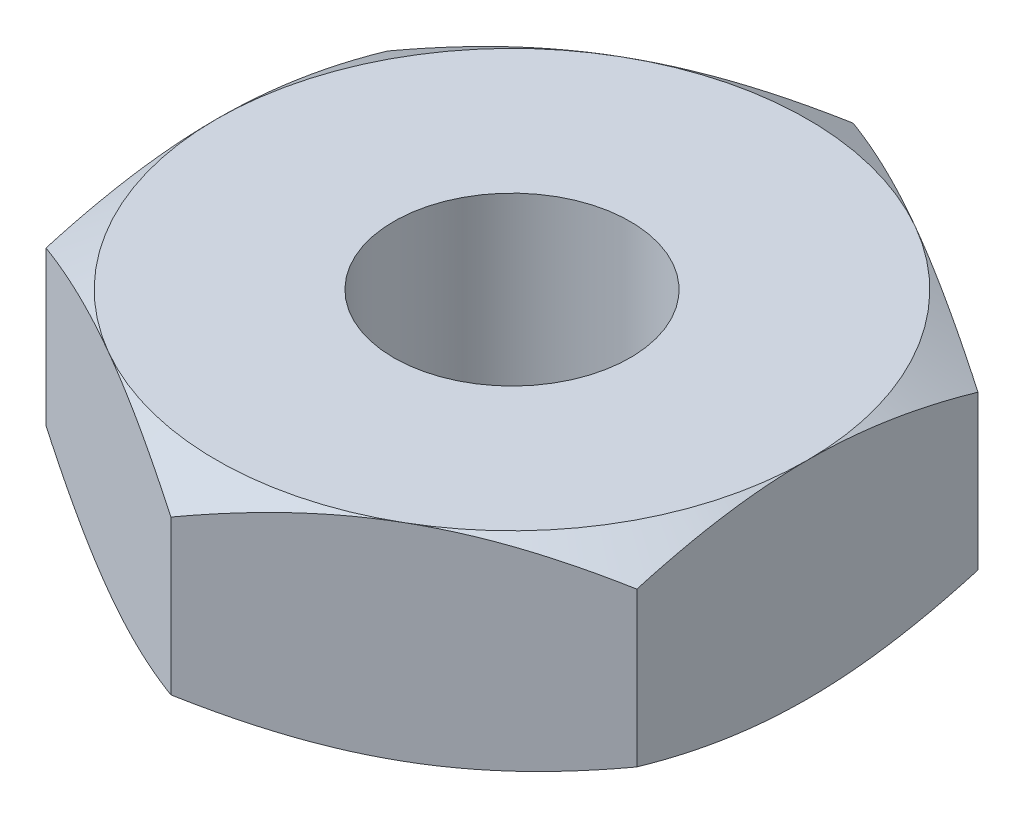
ISO-10303-21;
HEADER;
FILE_DESCRIPTION(('STEP AP214'),'2;1');
FILE_NAME('part.step','',(''),(''),'','','');
FILE_SCHEMA(('AUTOMOTIVE_DESIGN { 1 0 10303 214 1 1 1 1 }'));
ENDSEC;
DATA;
#1=APPLICATION_CONTEXT('core data for automotive mechanical design processes');
#2=APPLICATION_PROTOCOL_DEFINITION('international standard','automotive_design',2000,#1);
#3=PRODUCT_CONTEXT('',#1,'mechanical');
#4=PRODUCT('Part','Part','',(#3));
#5=PRODUCT_RELATED_PRODUCT_CATEGORY('part','',(#4));
#6=PRODUCT_DEFINITION_FORMATION('','',#4);
#7=PRODUCT_DEFINITION_CONTEXT('part definition',#1,'design');
#8=PRODUCT_DEFINITION('design','',#6,#7);
#9=PRODUCT_DEFINITION_SHAPE('','',#8);
#10=(LENGTH_UNIT() NAMED_UNIT(*) SI_UNIT(.MILLI.,.METRE.));
#11=(NAMED_UNIT(*) PLANE_ANGLE_UNIT() SI_UNIT($,.RADIAN.));
#12=(NAMED_UNIT(*) SI_UNIT($,.STERADIAN.) SOLID_ANGLE_UNIT());
#13=UNCERTAINTY_MEASURE_WITH_UNIT(LENGTH_MEASURE(1.E-05),#10,'distance_accuracy_value','');
#14=(GEOMETRIC_REPRESENTATION_CONTEXT(3) GLOBAL_UNCERTAINTY_ASSIGNED_CONTEXT((#13)) GLOBAL_UNIT_ASSIGNED_CONTEXT((#10,
#11,#12)) REPRESENTATION_CONTEXT('',''));
#15=CARTESIAN_POINT('',(0.,0.,0.));
#16=DIRECTION('',(0.,0.,1.));
#17=DIRECTION('',(1.,0.,0.));
#18=AXIS2_PLACEMENT_3D('',#15,#16,#17);
#19=CARTESIAN_POINT('',(-3.96875,1.3890625,-2.29135888084633));
#20=DIRECTION('',(0.,1.,0.));
#21=DIRECTION('',(0.,0.,1.));
#22=AXIS2_PLACEMENT_3D('',#19,#20,#21);
#23=PLANE('',#22);
#24=CARTESIAN_POINT('',(0.,1.3890625,0.));
#25=DIRECTION('',(0.,1.,0.));
#26=DIRECTION('',(0.,0.,1.));
#27=AXIS2_PLACEMENT_3D('',#24,#25,#26);
#28=CIRCLE('',#27,1.5875);
#29=CARTESIAN_POINT('',(0.,1.3890625,1.5875));
#30=VERTEX_POINT('',#29);
#31=EDGE_CURVE('E238',#30,#30,#28,.T.);
#32=ORIENTED_EDGE('',*,*,#31,.F.);
#33=EDGE_LOOP('',(#32));
#34=FACE_BOUND('',#33,.T.);
#35=CARTESIAN_POINT('',(0.,1.3890625,0.));
#36=DIRECTION('',(0.,1.,0.));
#37=DIRECTION('',(0.,0.,1.));
#38=AXIS2_PLACEMENT_3D('',#35,#36,#37);
#39=CIRCLE('',#38,3.96875);
#40=CARTESIAN_POINT('',(-1.984375,1.3890625,3.43703832126949));
#41=VERTEX_POINT('',#40);
#42=CARTESIAN_POINT('',(1.984375,1.3890625,3.43703832126949));
#43=VERTEX_POINT('',#42);
#44=EDGE_CURVE('E297',#41,#43,#39,.T.);
#45=ORIENTED_EDGE('',*,*,#44,.T.);
#46=CARTESIAN_POINT('',(3.96875,1.3890625,0.));
#47=VERTEX_POINT('',#46);
#48=EDGE_CURVE('E300',#43,#47,#39,.T.);
#49=ORIENTED_EDGE('',*,*,#48,.T.);
#50=CARTESIAN_POINT('',(1.984375,1.3890625,-3.43703832126949));
#51=VERTEX_POINT('',#50);
#52=EDGE_CURVE('E307',#47,#51,#39,.T.);
#53=ORIENTED_EDGE('',*,*,#52,.T.);
#54=CARTESIAN_POINT('',(-1.984375,1.3890625,-3.43703832126949));
#55=VERTEX_POINT('',#54);
#56=EDGE_CURVE('E311',#51,#55,#39,.T.);
#57=ORIENTED_EDGE('',*,*,#56,.T.);
#58=CARTESIAN_POINT('',(-3.96875,1.3890625,0.));
#59=VERTEX_POINT('',#58);
#60=EDGE_CURVE('E304',#55,#59,#39,.T.);
#61=ORIENTED_EDGE('',*,*,#60,.T.);
#62=EDGE_CURVE('E299',#59,#41,#39,.T.);
#63=ORIENTED_EDGE('',*,*,#62,.T.);
#64=EDGE_LOOP('',(#45,#49,#53,#57,#61,#63));
#65=FACE_BOUND('',#64,.T.);
#66=ADVANCED_FACE('F34',(#34,#65),#23,.T.);
#67=CARTESIAN_POINT('',(0.,1.3890625,-4.58271776169266));
#68=DIRECTION('',(0.5,0.,0.866025403784438));
#69=DIRECTION('',(0.866025403784439,0.,-0.5));
#70=AXIS2_PLACEMENT_3D('',#67,#68,#69);
#71=PLANE('',#70);
#72=DIRECTION('',(0.,-1.,0.));
#73=VECTOR('',#72,1.);
#74=CARTESIAN_POINT('',(0.,1.3890625,-4.58271776169266));
#75=LINE('',#74,#73);
#76=CARTESIAN_POINT('',(0.,1.034588047513,-4.58271776169266));
#77=VERTEX_POINT('',#76);
#78=CARTESIAN_POINT('',(0.,-1.034588047513,-4.58271776169266));
#79=VERTEX_POINT('',#78);
#80=EDGE_CURVE('E235',#77,#79,#75,.T.);
#81=ORIENTED_EDGE('',*,*,#80,.T.);
#82=CARTESIAN_POINT('',(0.000199999999999969,-1.03452137832671,-4.58283323174649));
#83=CARTESIAN_POINT('',(-0.174205902081157,-1.09267788164553,-4.48213993723168));
#84=CARTESIAN_POINT('',(-0.35011726598285,-1.14556901401833,-4.38057746392952));
#85=CARTESIAN_POINT('',(-0.704986056512737,-1.23789081645718,-4.17569387219009));
#86=CARTESIAN_POINT('',(-0.883949788458081,-1.27728882681341,-4.07236911337627));
#87=CARTESIAN_POINT('',(-1.23965934318176,-1.3386172964786,-3.86700010620323));
#88=CARTESIAN_POINT('',(-1.41635043707328,-1.36095593380879,-3.76498745558155));
#89=CARTESIAN_POINT('',(-1.7705639777928,-1.38762315750667,-3.56048217249653));
#90=CARTESIAN_POINT('',(-1.94808513722975,-1.39197382713073,-3.45799028330875));
#91=CARTESIAN_POINT('',(-2.27979074080338,-1.38292085025305,-3.26647996379381));
#92=CARTESIAN_POINT('',(-2.43402485076552,-1.37174001600782,-3.17743285888894));
#93=CARTESIAN_POINT('',(-2.74148824092522,-1.33630397944562,-2.99991878781428));
#94=CARTESIAN_POINT('',(-2.89471645773984,-1.31203667319011,-2.91145243558892));
#95=CARTESIAN_POINT('',(-3.20281373181353,-1.25137053864588,-2.73357239146588));
#96=CARTESIAN_POINT('',(-3.3576437962636,-1.21471455942136,-2.64418121207699));
#97=CARTESIAN_POINT('',(-3.66499472649982,-1.13151999862476,-2.46673206976942));
#98=CARTESIAN_POINT('',(-3.81751952962953,-1.08500096376704,-2.37867183362439));
#99=CARTESIAN_POINT('',(-3.96895,-1.03452137832671,-2.29124341079249));
#100=B_SPLINE_CURVE_WITH_KNOTS('',3,(#82,#83,#84,#85,#86,#87,#88,#89,#90,#91,#92,#93,#94,#95,
#96,#97,#98,#99),.UNSPECIFIED.,.F.,.F.,(4,2,2,2,2,2,2,2,4),(0.,0.629094460519771,
1.25970103886327,1.87470051579827,2.48894475282133,3.02377031984306,3.55909140824994,
4.1062865060967,4.65240713705191),.UNSPECIFIED.);
#101=CARTESIAN_POINT('',(-1.984375,-1.3890625,-3.43703832126949));
#102=VERTEX_POINT('',#101);
#103=EDGE_CURVE('E57',#79,#102,#100,.T.);
#104=ORIENTED_EDGE('',*,*,#103,.T.);
#105=CARTESIAN_POINT('',(-3.96875,-1.03458804751317,-2.2913588808466));
#106=VERTEX_POINT('',#105);
#107=EDGE_CURVE('E193',#102,#106,#100,.T.);
#108=ORIENTED_EDGE('',*,*,#107,.T.);
#109=DIRECTION('',(0.,-1.,0.));
#110=VECTOR('',#109,1.);
#111=CARTESIAN_POINT('',(-3.96875,1.3890625,-2.29135888084633));
#112=LINE('',#111,#110);
#113=CARTESIAN_POINT('',(-3.96875,1.03458804751317,-2.2913588808466));
#114=VERTEX_POINT('',#113);
#115=EDGE_CURVE('E223',#114,#106,#112,.T.);
#116=ORIENTED_EDGE('',*,*,#115,.F.);
#117=CARTESIAN_POINT('',(0.000199999999999969,1.03452137832671,-4.58283323174649));
#118=CARTESIAN_POINT('',(-0.174205902081157,1.09267788164553,-4.48213993723168));
#119=CARTESIAN_POINT('',(-0.35011726598285,1.14556901401833,-4.38057746392952));
#120=CARTESIAN_POINT('',(-0.704986056512737,1.23789081645718,-4.17569387219009));
#121=CARTESIAN_POINT('',(-0.883949788458081,1.27728882681341,-4.07236911337627));
#122=CARTESIAN_POINT('',(-1.23965934318176,1.3386172964786,-3.86700010620323));
#123=CARTESIAN_POINT('',(-1.41635043707328,1.36095593380879,-3.76498745558155));
#124=CARTESIAN_POINT('',(-1.7705639777928,1.38762315750667,-3.56048217249653));
#125=CARTESIAN_POINT('',(-1.94808513722975,1.39197382713073,-3.45799028330875));
#126=CARTESIAN_POINT('',(-2.27979074080338,1.38292085025305,-3.26647996379381));
#127=CARTESIAN_POINT('',(-2.43402485076552,1.37174001600782,-3.17743285888894));
#128=CARTESIAN_POINT('',(-2.74148824092522,1.33630397944562,-2.99991878781428));
#129=CARTESIAN_POINT('',(-2.89471645773984,1.31203667319011,-2.91145243558892));
#130=CARTESIAN_POINT('',(-3.20281373181353,1.25137053864588,-2.73357239146588));
#131=CARTESIAN_POINT('',(-3.3576437962636,1.21471455942136,-2.64418121207699));
#132=CARTESIAN_POINT('',(-3.66499472649982,1.13151999862476,-2.46673206976942));
#133=CARTESIAN_POINT('',(-3.81751952962953,1.08500096376704,-2.37867183362439));
#134=CARTESIAN_POINT('',(-3.96895,1.03452137832671,-2.29124341079249));
#135=B_SPLINE_CURVE_WITH_KNOTS('',3,(#117,#118,#119,#120,#121,#122,#123,#124,#125,#126,#127,
#128,#129,#130,#131,#132,#133,#134),.UNSPECIFIED.,.F.,.F.,(4,2,2,2,2,2,2,2,4),(0.,
0.629094460519771,1.25970103886327,1.87470051579827,2.48894475282133,3.02377031984306,
3.55909140824994,4.1062865060967,4.65240713705191),.UNSPECIFIED.);
#136=EDGE_CURVE('E245',#55,#114,#135,.T.);
#137=ORIENTED_EDGE('',*,*,#136,.F.);
#138=EDGE_CURVE('E242',#77,#55,#135,.T.);
#139=ORIENTED_EDGE('',*,*,#138,.F.);
#140=EDGE_LOOP('',(#81,#104,#108,#116,#137,#139));
#141=FACE_BOUND('',#140,.T.);
#142=ADVANCED_FACE('F36',(#141),#71,.F.);
#143=CARTESIAN_POINT('',(-3.96875,1.3890625,-2.29135888084633));
#144=DIRECTION('',(1.,0.,0.));
#145=DIRECTION('',(0.,0.,-1.));
#146=AXIS2_PLACEMENT_3D('',#143,#144,#145);
#147=PLANE('',#146);
#148=ORIENTED_EDGE('',*,*,#115,.T.);
#149=CARTESIAN_POINT('',(-3.96875,0.580270643707875,-6.22169695676345));
#150=CARTESIAN_POINT('',(-3.96875,0.495629554498546,-6.04776097042012));
#151=CARTESIAN_POINT('',(-3.96875,0.411781015228385,-5.87343276197247));
#152=CARTESIAN_POINT('',(-3.96875,0.246113557528974,-5.52378352626055));
#153=CARTESIAN_POINT('',(-3.96875,0.164294946503743,-5.34846235350417));
#154=CARTESIAN_POINT('',(-3.96875,0.00273455510915178,-4.99574743703183));
#155=CARTESIAN_POINT('',(-3.96875,-0.0769940637955183,-4.8183476443733));
#156=CARTESIAN_POINT('',(-3.96875,-0.233275940637596,-4.46216001234746));
#157=CARTESIAN_POINT('',(-3.96875,-0.3098293443539,-4.28337223715292));
#158=CARTESIAN_POINT('',(-3.96875,-0.461404283867797,-3.91814940793921));
#159=CARTESIAN_POINT('',(-3.96875,-0.536290207564717,-3.7316577704564));
#160=CARTESIAN_POINT('',(-3.96875,-0.680554504087907,-3.35651758495646));
#161=CARTESIAN_POINT('',(-3.96875,-0.74993226847017,-3.16786880128179));
#162=CARTESIAN_POINT('',(-3.96875,-0.881408126224332,-2.78844599514931));
#163=CARTESIAN_POINT('',(-3.96875,-0.943520384294776,-2.59767692965097));
#164=CARTESIAN_POINT('',(-3.96875,-1.05851662121305,-2.21340311120669));
#165=CARTESIAN_POINT('',(-3.96875,-1.11140343580595,-2.01989921874075));
#166=CARTESIAN_POINT('',(-3.96875,-1.20517636129246,-1.6311091012753));
#167=CARTESIAN_POINT('',(-3.96875,-1.24612852574059,-1.43583910195992));
#168=CARTESIAN_POINT('',(-3.96875,-1.31375702721554,-1.0428024899618));
#169=CARTESIAN_POINT('',(-3.96875,-1.34043487467902,-0.845036143697719));
#170=CARTESIAN_POINT('',(-3.96875,-1.3770403841221,-0.450605512338849));
#171=CARTESIAN_POINT('',(-3.96875,-1.38718865783126,-0.25396221985486));
#172=CARTESIAN_POINT('',(-3.96875,-1.39045976447106,0.139485992218314));
#173=CARTESIAN_POINT('',(-3.96875,-1.38358228756796,0.33629091468368));
#174=CARTESIAN_POINT('',(-3.96875,-1.35810261812635,0.668410754752708));
#175=CARTESIAN_POINT('',(-3.96875,-1.3437432404343,0.804072537555573));
#176=CARTESIAN_POINT('',(-3.96875,-1.30779247207964,1.0744408102038));
#177=CARTESIAN_POINT('',(-3.96875,-1.28620015652866,1.20914717562759));
#178=CARTESIAN_POINT('',(-3.96875,-1.21170483065242,1.61162887315064));
#179=CARTESIAN_POINT('',(-3.96875,-1.14909538893366,1.87762972847311));
#180=CARTESIAN_POINT('',(-3.96875,-1.04002741153514,2.27555191163833));
#181=CARTESIAN_POINT('',(-3.96875,-1.00061037701119,2.40952100703487));
#182=CARTESIAN_POINT('',(-3.96875,-0.917560151569727,2.67615857994853));
#183=CARTESIAN_POINT('',(-3.96875,-0.873926928994569,2.80882704769153));
#184=CARTESIAN_POINT('',(-3.96875,-0.783154734396829,3.07290448457615));
#185=CARTESIAN_POINT('',(-3.96875,-0.736016795290462,3.20431381202589));
#186=CARTESIAN_POINT('',(-3.96875,-0.638802011642294,3.46603416335526));
#187=CARTESIAN_POINT('',(-3.96875,-0.588725228974448,3.59634521029189));
#188=CARTESIAN_POINT('',(-3.96875,-0.452575047627681,3.94088412858893));
#189=CARTESIAN_POINT('',(-3.96875,-0.364374104411039,4.15427038484706));
#190=CARTESIAN_POINT('',(-3.96875,-0.18294698514972,4.57890352123334));
#191=CARTESIAN_POINT('',(-3.96875,-0.0897202959000224,4.79015018024977));
#192=CARTESIAN_POINT('',(-3.96875,0.100589836396977,5.21097578363183));
#193=CARTESIAN_POINT('',(-3.96875,0.197674518443244,5.42055416586364));
#194=CARTESIAN_POINT('',(-3.96875,0.394806200491001,5.83831597781125));
#195=CARTESIAN_POINT('',(-3.96875,0.494853286808513,6.04649936666374));
#196=CARTESIAN_POINT('',(-3.96875,0.697421654018019,6.46204015936939));
#197=CARTESIAN_POINT('',(-3.96875,0.799946395513732,6.66939587286292));
#198=CARTESIAN_POINT('',(-3.96875,1.00685664462163,7.08317779146199));
#199=CARTESIAN_POINT('',(-3.96875,1.11124217149255,7.2896039869195));
#200=CARTESIAN_POINT('',(-3.96875,1.42658702639339,7.90765670661576));
#201=CARTESIAN_POINT('',(-3.96875,1.63977745980658,8.31814439261519));
#202=CARTESIAN_POINT('',(-3.96875,2.04807122962612,9.09498840679135));
#203=CARTESIAN_POINT('',(-3.96875,2.24278532373391,9.46155029736983));
#204=CARTESIAN_POINT('',(-3.96875,2.63459143839332,10.1934273187956));
#205=CARTESIAN_POINT('',(-3.96875,2.83168359443524,10.5587423770687));
#206=CARTESIAN_POINT('',(-3.96875,3.22699755433617,11.2872403110954));
#207=CARTESIAN_POINT('',(-3.96875,3.42521369250251,11.6504262661362));
#208=CARTESIAN_POINT('',(-3.96875,3.82300419769018,12.3760186060547));
#209=CARTESIAN_POINT('',(-3.96875,4.02257846210827,12.7384250471593));
#210=CARTESIAN_POINT('',(-3.96875,4.22264849263489,13.1005558551109));
#211=B_SPLINE_CURVE_WITH_KNOTS('',3,(#149,#150,#151,#152,#153,#154,#155,#156,#157,#158,#159,
#160,#161,#162,#163,#164,#165,#166,#167,#168,#169,#170,#171,#172,#173,#174,#175,#176,#177,#178,
#179,#180,#181,#182,#183,#184,#185,#186,#187,#188,#189,#190,#191,#192,#193,#194,#195,#196,#197,
#198,#199,#200,#201,#202,#203,#204,#205,#206,#207,#208,#209,#210),.UNSPECIFIED.,.F.,.F.,(4,2,2,
2,2,2,2,2,2,2,2,2,2,2,2,2,2,2,2,2,2,2,2,2,2,2,2,2,2,2,4),(0.,0.580317532576746,1.16072241618541,
1.74417501419442,2.32760079530033,2.93042926439164,3.53332423092783,4.13502349111168,
4.73653747196744,5.33465617674795,5.93271157908309,6.52271762195251,7.11273440180051,
7.52179616412226,7.93091025386496,8.74954934292227,9.16845446095107,9.58736272461321,
10.0061480125919,10.4249244866913,11.1175183219819,11.8101830160883,12.5030719870989,
13.1959811668256,13.8899215612347,14.5838691419566,15.9714733438239,17.2166675132063,
18.4619329658364,19.7031966118937,20.9443675020377),.UNSPECIFIED.);
#212=CARTESIAN_POINT('',(-3.96875,-1.3890625,0.));
#213=VERTEX_POINT('',#212);
#214=EDGE_CURVE('E278',#106,#213,#211,.T.);
#215=ORIENTED_EDGE('',*,*,#214,.T.);
#216=CARTESIAN_POINT('',(-3.96875,-1.034588047513,2.29135888084633));
#217=VERTEX_POINT('',#216);
#218=EDGE_CURVE('E272',#213,#217,#211,.T.);
#219=ORIENTED_EDGE('',*,*,#218,.T.);
#220=DIRECTION('',(0.,-1.,0.));
#221=VECTOR('',#220,1.);
#222=CARTESIAN_POINT('',(-3.96875,1.3890625,2.29135888084633));
#223=LINE('',#222,#221);
#224=CARTESIAN_POINT('',(-3.96875,1.034588047513,2.29135888084633));
#225=VERTEX_POINT('',#224);
#226=EDGE_CURVE('E226',#225,#217,#223,.T.);
#227=ORIENTED_EDGE('',*,*,#226,.F.);
#228=CARTESIAN_POINT('',(-3.96875,-0.580270643707875,-6.22169695676345));
#229=CARTESIAN_POINT('',(-3.96875,-0.495629554498546,-6.04776097042012));
#230=CARTESIAN_POINT('',(-3.96875,-0.411781015228385,-5.87343276197247));
#231=CARTESIAN_POINT('',(-3.96875,-0.246113557528974,-5.52378352626055));
#232=CARTESIAN_POINT('',(-3.96875,-0.164294946503743,-5.34846235350417));
#233=CARTESIAN_POINT('',(-3.96875,-0.00273455510915178,-4.99574743703183));
#234=CARTESIAN_POINT('',(-3.96875,0.0769940637955183,-4.8183476443733));
#235=CARTESIAN_POINT('',(-3.96875,0.233275940637596,-4.46216001234746));
#236=CARTESIAN_POINT('',(-3.96875,0.3098293443539,-4.28337223715292));
#237=CARTESIAN_POINT('',(-3.96875,0.461404283867797,-3.91814940793921));
#238=CARTESIAN_POINT('',(-3.96875,0.536290207564717,-3.7316577704564));
#239=CARTESIAN_POINT('',(-3.96875,0.680554504087907,-3.35651758495646));
#240=CARTESIAN_POINT('',(-3.96875,0.74993226847017,-3.16786880128179));
#241=CARTESIAN_POINT('',(-3.96875,0.881408126224332,-2.78844599514931));
#242=CARTESIAN_POINT('',(-3.96875,0.943520384294776,-2.59767692965097));
#243=CARTESIAN_POINT('',(-3.96875,1.05851662121305,-2.21340311120669));
#244=CARTESIAN_POINT('',(-3.96875,1.11140343580595,-2.01989921874075));
#245=CARTESIAN_POINT('',(-3.96875,1.20517636129246,-1.6311091012753));
#246=CARTESIAN_POINT('',(-3.96875,1.24612852574059,-1.43583910195992));
#247=CARTESIAN_POINT('',(-3.96875,1.31375702721554,-1.0428024899618));
#248=CARTESIAN_POINT('',(-3.96875,1.34043487467902,-0.845036143697719));
#249=CARTESIAN_POINT('',(-3.96875,1.3770403841221,-0.450605512338849));
#250=CARTESIAN_POINT('',(-3.96875,1.38718865783126,-0.25396221985486));
#251=CARTESIAN_POINT('',(-3.96875,1.39045976447106,0.139485992218314));
#252=CARTESIAN_POINT('',(-3.96875,1.38358228756796,0.33629091468368));
#253=CARTESIAN_POINT('',(-3.96875,1.35810261812635,0.668410754752708));
#254=CARTESIAN_POINT('',(-3.96875,1.3437432404343,0.804072537555573));
#255=CARTESIAN_POINT('',(-3.96875,1.30779247207964,1.0744408102038));
#256=CARTESIAN_POINT('',(-3.96875,1.28620015652866,1.20914717562759));
#257=CARTESIAN_POINT('',(-3.96875,1.21170483065242,1.61162887315064));
#258=CARTESIAN_POINT('',(-3.96875,1.14909538893366,1.87762972847311));
#259=CARTESIAN_POINT('',(-3.96875,1.04002741153514,2.27555191163833));
#260=CARTESIAN_POINT('',(-3.96875,1.00061037701119,2.40952100703487));
#261=CARTESIAN_POINT('',(-3.96875,0.917560151569727,2.67615857994853));
#262=CARTESIAN_POINT('',(-3.96875,0.873926928994569,2.80882704769153));
#263=CARTESIAN_POINT('',(-3.96875,0.783154734396829,3.07290448457615));
#264=CARTESIAN_POINT('',(-3.96875,0.736016795290462,3.20431381202589));
#265=CARTESIAN_POINT('',(-3.96875,0.638802011642294,3.46603416335526));
#266=CARTESIAN_POINT('',(-3.96875,0.588725228974448,3.59634521029189));
#267=CARTESIAN_POINT('',(-3.96875,0.452575047627681,3.94088412858893));
#268=CARTESIAN_POINT('',(-3.96875,0.364374104411039,4.15427038484706));
#269=CARTESIAN_POINT('',(-3.96875,0.18294698514972,4.57890352123334));
#270=CARTESIAN_POINT('',(-3.96875,0.0897202959000224,4.79015018024977));
#271=CARTESIAN_POINT('',(-3.96875,-0.100589836396977,5.21097578363183));
#272=CARTESIAN_POINT('',(-3.96875,-0.197674518443244,5.42055416586364));
#273=CARTESIAN_POINT('',(-3.96875,-0.394806200491001,5.83831597781125));
#274=CARTESIAN_POINT('',(-3.96875,-0.494853286808513,6.04649936666374));
#275=CARTESIAN_POINT('',(-3.96875,-0.697421654018019,6.46204015936939));
#276=CARTESIAN_POINT('',(-3.96875,-0.799946395513732,6.66939587286292));
#277=CARTESIAN_POINT('',(-3.96875,-1.00685664462163,7.08317779146199));
#278=CARTESIAN_POINT('',(-3.96875,-1.11124217149255,7.2896039869195));
#279=CARTESIAN_POINT('',(-3.96875,-1.42658702639339,7.90765670661576));
#280=CARTESIAN_POINT('',(-3.96875,-1.63977745980658,8.31814439261519));
#281=CARTESIAN_POINT('',(-3.96875,-2.04807122962612,9.09498840679135));
#282=CARTESIAN_POINT('',(-3.96875,-2.24278532373391,9.46155029736983));
#283=CARTESIAN_POINT('',(-3.96875,-2.63459143839332,10.1934273187956));
#284=CARTESIAN_POINT('',(-3.96875,-2.83168359443524,10.5587423770687));
#285=CARTESIAN_POINT('',(-3.96875,-3.22699755433617,11.2872403110954));
#286=CARTESIAN_POINT('',(-3.96875,-3.42521369250251,11.6504262661362));
#287=CARTESIAN_POINT('',(-3.96875,-3.82300419769018,12.3760186060547));
#288=CARTESIAN_POINT('',(-3.96875,-4.02257846210827,12.7384250471593));
#289=CARTESIAN_POINT('',(-3.96875,-4.22264849263489,13.1005558551109));
#290=B_SPLINE_CURVE_WITH_KNOTS('',3,(#228,#229,#230,#231,#232,#233,#234,#235,#236,#237,#238,
#239,#240,#241,#242,#243,#244,#245,#246,#247,#248,#249,#250,#251,#252,#253,#254,#255,#256,#257,
#258,#259,#260,#261,#262,#263,#264,#265,#266,#267,#268,#269,#270,#271,#272,#273,#274,#275,#276,
#277,#278,#279,#280,#281,#282,#283,#284,#285,#286,#287,#288,#289),.UNSPECIFIED.,.F.,.F.,(4,2,2,
2,2,2,2,2,2,2,2,2,2,2,2,2,2,2,2,2,2,2,2,2,2,2,2,2,2,2,4),(0.,0.580317532576746,1.16072241618541,
1.74417501419442,2.32760079530033,2.93042926439164,3.53332423092783,4.13502349111168,
4.73653747196744,5.33465617674795,5.93271157908309,6.52271762195251,7.11273440180051,
7.52179616412226,7.93091025386496,8.74954934292227,9.16845446095107,9.58736272461321,
10.0061480125919,10.4249244866913,11.1175183219819,11.8101830160883,12.5030719870989,
13.1959811668256,13.8899215612347,14.5838691419566,15.9714733438239,17.2166675132063,
18.4619329658364,19.7031966118937,20.9443675020377),.UNSPECIFIED.);
#291=EDGE_CURVE('E252',#59,#225,#290,.T.);
#292=ORIENTED_EDGE('',*,*,#291,.F.);
#293=EDGE_CURVE('E251',#114,#59,#290,.T.);
#294=ORIENTED_EDGE('',*,*,#293,.F.);
#295=EDGE_LOOP('',(#148,#215,#219,#227,#292,#294));
#296=FACE_BOUND('',#295,.T.);
#297=ADVANCED_FACE('F265',(#296),#147,.F.);
#298=CARTESIAN_POINT('',(-3.96875,1.3890625,2.29135888084633));
#299=DIRECTION('',(0.5,0.,-0.866025403784438));
#300=DIRECTION('',(-0.866025403784439,0.,-0.5));
#301=AXIS2_PLACEMENT_3D('',#298,#299,#300);
#302=PLANE('',#301);
#303=ORIENTED_EDGE('',*,*,#226,.T.);
#304=CARTESIAN_POINT('',(-3.96895,-1.03452137832671,2.29124341079249));
#305=CARTESIAN_POINT('',(-3.79454409791884,-1.09267788164553,2.3919367053073));
#306=CARTESIAN_POINT('',(-3.61863273401715,-1.14556901401833,2.49349917860946));
#307=CARTESIAN_POINT('',(-3.26376394348726,-1.23789081645719,2.69838277034889));
#308=CARTESIAN_POINT('',(-3.08480021154192,-1.27728882681341,2.80170752916271));
#309=CARTESIAN_POINT('',(-2.72909065681824,-1.3386172964786,3.00707653633575));
#310=CARTESIAN_POINT('',(-2.55239956292672,-1.36095593380879,3.10908918695743));
#311=CARTESIAN_POINT('',(-2.1981860222072,-1.38762315750667,3.31359447004245));
#312=CARTESIAN_POINT('',(-2.02066486277025,-1.39197382713073,3.41608635923023));
#313=CARTESIAN_POINT('',(-1.68895925919662,-1.38292085025305,3.60759667874517));
#314=CARTESIAN_POINT('',(-1.53472514923448,-1.37174001600782,3.69664378365004));
#315=CARTESIAN_POINT('',(-1.22726175907477,-1.33630397944562,3.8741578547247));
#316=CARTESIAN_POINT('',(-1.07403354226016,-1.31203667319011,3.96262420695006));
#317=CARTESIAN_POINT('',(-0.765936268186465,-1.25137053864588,4.1405042510731));
#318=CARTESIAN_POINT('',(-0.611106203736397,-1.21471455942136,4.229895430462));
#319=CARTESIAN_POINT('',(-0.303755273500179,-1.13151999862476,4.40734457276956));
#320=CARTESIAN_POINT('',(-0.151230470370471,-1.08500096376703,4.49540480891459));
#321=CARTESIAN_POINT('',(0.000200000000000126,-1.03452137832671,4.58283323174649));
#322=B_SPLINE_CURVE_WITH_KNOTS('',3,(#304,#305,#306,#307,#308,#309,#310,#311,#312,#313,#314,
#315,#316,#317,#318,#319,#320,#321),.UNSPECIFIED.,.F.,.F.,(4,2,2,2,2,2,2,2,4),(0.,
0.629094460519771,1.25970103886327,1.87470051579826,2.48894475282133,3.02377031984306,
3.55909140824994,4.1062865060967,4.65240713705191),.UNSPECIFIED.);
#323=CARTESIAN_POINT('',(-1.984375,-1.3890625,3.43703832126949));
#324=VERTEX_POINT('',#323);
#325=EDGE_CURVE('E158',#217,#324,#322,.T.);
#326=ORIENTED_EDGE('',*,*,#325,.T.);
#327=CARTESIAN_POINT('',(0.,-1.034588047513,4.58271776169265));
#328=VERTEX_POINT('',#327);
#329=EDGE_CURVE('E142',#324,#328,#322,.T.);
#330=ORIENTED_EDGE('',*,*,#329,.T.);
#331=DIRECTION('',(0.,-1.,0.));
#332=VECTOR('',#331,1.);
#333=CARTESIAN_POINT('',(0.,1.3890625,4.58271776169265));
#334=LINE('',#333,#332);
#335=CARTESIAN_POINT('',(0.,1.034588047513,4.58271776169265));
#336=VERTEX_POINT('',#335);
#337=EDGE_CURVE('E157',#336,#328,#334,.T.);
#338=ORIENTED_EDGE('',*,*,#337,.F.);
#339=CARTESIAN_POINT('',(-3.96895,1.03452137832671,2.29124341079249));
#340=CARTESIAN_POINT('',(-3.79454409791884,1.09267788164553,2.3919367053073));
#341=CARTESIAN_POINT('',(-3.61863273401715,1.14556901401833,2.49349917860946));
#342=CARTESIAN_POINT('',(-3.26376394348726,1.23789081645719,2.69838277034889));
#343=CARTESIAN_POINT('',(-3.08480021154192,1.27728882681341,2.80170752916271));
#344=CARTESIAN_POINT('',(-2.72909065681824,1.3386172964786,3.00707653633575));
#345=CARTESIAN_POINT('',(-2.55239956292672,1.36095593380879,3.10908918695743));
#346=CARTESIAN_POINT('',(-2.1981860222072,1.38762315750667,3.31359447004245));
#347=CARTESIAN_POINT('',(-2.02066486277025,1.39197382713073,3.41608635923023));
#348=CARTESIAN_POINT('',(-1.68895925919662,1.38292085025305,3.60759667874517));
#349=CARTESIAN_POINT('',(-1.53472514923448,1.37174001600782,3.69664378365004));
#350=CARTESIAN_POINT('',(-1.22726175907477,1.33630397944562,3.8741578547247));
#351=CARTESIAN_POINT('',(-1.07403354226016,1.31203667319011,3.96262420695006));
#352=CARTESIAN_POINT('',(-0.765936268186465,1.25137053864588,4.1405042510731));
#353=CARTESIAN_POINT('',(-0.611106203736397,1.21471455942136,4.229895430462));
#354=CARTESIAN_POINT('',(-0.303755273500179,1.13151999862476,4.40734457276956));
#355=CARTESIAN_POINT('',(-0.151230470370471,1.08500096376703,4.49540480891459));
#356=CARTESIAN_POINT('',(0.000200000000000126,1.03452137832671,4.58283323174649));
#357=B_SPLINE_CURVE_WITH_KNOTS('',3,(#339,#340,#341,#342,#343,#344,#345,#346,#347,#348,#349,
#350,#351,#352,#353,#354,#355,#356),.UNSPECIFIED.,.F.,.F.,(4,2,2,2,2,2,2,2,4),(0.,
0.629094460519771,1.25970103886327,1.87470051579826,2.48894475282133,3.02377031984306,
3.55909140824994,4.1062865060967,4.65240713705191),.UNSPECIFIED.);
#358=EDGE_CURVE('E259',#41,#336,#357,.T.);
#359=ORIENTED_EDGE('',*,*,#358,.F.);
#360=EDGE_CURVE('E258',#225,#41,#357,.T.);
#361=ORIENTED_EDGE('',*,*,#360,.F.);
#362=EDGE_LOOP('',(#303,#326,#330,#338,#359,#361));
#363=FACE_BOUND('',#362,.T.);
#364=ADVANCED_FACE('F268',(#363),#302,.F.);
#365=CARTESIAN_POINT('',(0.,1.3890625,4.58271776169265));
#366=DIRECTION('',(-0.5,0.,-0.866025403784438));
#367=DIRECTION('',(-0.866025403784439,0.,0.5));
#368=AXIS2_PLACEMENT_3D('',#365,#366,#367);
#369=PLANE('',#368);
#370=ORIENTED_EDGE('',*,*,#337,.T.);
#371=CARTESIAN_POINT('',(-0.00020000000000013,-1.03452137832671,4.58283323174649));
#372=CARTESIAN_POINT('',(0.174205902081156,-1.09267788164553,4.48213993723168));
#373=CARTESIAN_POINT('',(0.35011726598285,-1.14556901401833,4.38057746392952));
#374=CARTESIAN_POINT('',(0.704986056512737,-1.23789081645719,4.17569387219009));
#375=CARTESIAN_POINT('',(0.883949788458081,-1.27728882681341,4.07236911337627));
#376=CARTESIAN_POINT('',(1.23965934318176,-1.3386172964786,3.86700010620323));
#377=CARTESIAN_POINT('',(1.41635043707328,-1.36095593380879,3.76498745558155));
#378=CARTESIAN_POINT('',(1.7705639777928,-1.38762315750667,3.56048217249653));
#379=CARTESIAN_POINT('',(1.94808513722975,-1.39197382713073,3.45799028330875));
#380=CARTESIAN_POINT('',(2.27979074080338,-1.38292085025305,3.26647996379381));
#381=CARTESIAN_POINT('',(2.43402485076552,-1.37174001600782,3.17743285888894));
#382=CARTESIAN_POINT('',(2.74148824092522,-1.33630397944562,2.99991878781428));
#383=CARTESIAN_POINT('',(2.89471645773984,-1.31203667319011,2.91145243558892));
#384=CARTESIAN_POINT('',(3.20281373181353,-1.25137053864589,2.73357239146588));
#385=CARTESIAN_POINT('',(3.3576437962636,-1.21471455942136,2.64418121207699));
#386=CARTESIAN_POINT('',(3.66499472649982,-1.13151999862476,2.46673206976942));
#387=CARTESIAN_POINT('',(3.81751952962953,-1.08500096376704,2.37867183362439));
#388=CARTESIAN_POINT('',(3.96895,-1.03452137832671,2.29124341079249));
#389=B_SPLINE_CURVE_WITH_KNOTS('',3,(#371,#372,#373,#374,#375,#376,#377,#378,#379,#380,#381,
#382,#383,#384,#385,#386,#387,#388),.UNSPECIFIED.,.F.,.F.,(4,2,2,2,2,2,2,2,4),(0.,
0.629094460519772,1.25970103886327,1.87470051579826,2.48894475282133,3.02377031984306,
3.55909140824994,4.1062865060967,4.65240713705191),.UNSPECIFIED.);
#390=CARTESIAN_POINT('',(1.984375,-1.3890625,3.43703832126949));
#391=VERTEX_POINT('',#390);
#392=EDGE_CURVE('E136',#328,#391,#389,.T.);
#393=ORIENTED_EDGE('',*,*,#392,.T.);
#394=CARTESIAN_POINT('',(3.96875,-1.034588047513,2.29135888084633));
#395=VERTEX_POINT('',#394);
#396=EDGE_CURVE('E124',#391,#395,#389,.T.);
#397=ORIENTED_EDGE('',*,*,#396,.T.);
#398=DIRECTION('',(0.,-1.,0.));
#399=VECTOR('',#398,1.);
#400=CARTESIAN_POINT('',(3.96875,1.3890625,2.29135888084633));
#401=LINE('',#400,#399);
#402=CARTESIAN_POINT('',(3.96875,1.034588047513,2.29135888084633));
#403=VERTEX_POINT('',#402);
#404=EDGE_CURVE('E230',#403,#395,#401,.T.);
#405=ORIENTED_EDGE('',*,*,#404,.F.);
#406=CARTESIAN_POINT('',(-0.00020000000000013,1.03452137832671,4.58283323174649));
#407=CARTESIAN_POINT('',(0.174205902081156,1.09267788164553,4.48213993723168));
#408=CARTESIAN_POINT('',(0.35011726598285,1.14556901401833,4.38057746392952));
#409=CARTESIAN_POINT('',(0.704986056512737,1.23789081645719,4.17569387219009));
#410=CARTESIAN_POINT('',(0.883949788458081,1.27728882681341,4.07236911337627));
#411=CARTESIAN_POINT('',(1.23965934318176,1.3386172964786,3.86700010620323));
#412=CARTESIAN_POINT('',(1.41635043707328,1.36095593380879,3.76498745558155));
#413=CARTESIAN_POINT('',(1.7705639777928,1.38762315750667,3.56048217249653));
#414=CARTESIAN_POINT('',(1.94808513722975,1.39197382713073,3.45799028330875));
#415=CARTESIAN_POINT('',(2.27979074080338,1.38292085025305,3.26647996379381));
#416=CARTESIAN_POINT('',(2.43402485076552,1.37174001600782,3.17743285888894));
#417=CARTESIAN_POINT('',(2.74148824092522,1.33630397944562,2.99991878781428));
#418=CARTESIAN_POINT('',(2.89471645773984,1.31203667319011,2.91145243558892));
#419=CARTESIAN_POINT('',(3.20281373181353,1.25137053864589,2.73357239146588));
#420=CARTESIAN_POINT('',(3.3576437962636,1.21471455942136,2.64418121207699));
#421=CARTESIAN_POINT('',(3.66499472649982,1.13151999862476,2.46673206976942));
#422=CARTESIAN_POINT('',(3.81751952962953,1.08500096376704,2.37867183362439));
#423=CARTESIAN_POINT('',(3.96895,1.03452137832671,2.29124341079249));
#424=B_SPLINE_CURVE_WITH_KNOTS('',3,(#406,#407,#408,#409,#410,#411,#412,#413,#414,#415,#416,
#417,#418,#419,#420,#421,#422,#423),.UNSPECIFIED.,.F.,.F.,(4,2,2,2,2,2,2,2,4),(0.,
0.629094460519772,1.25970103886327,1.87470051579826,2.48894475282133,3.02377031984306,
3.55909140824994,4.1062865060967,4.65240713705191),.UNSPECIFIED.);
#425=EDGE_CURVE('E329',#43,#403,#424,.T.);
#426=ORIENTED_EDGE('',*,*,#425,.F.);
#427=EDGE_CURVE('E331',#336,#43,#424,.T.);
#428=ORIENTED_EDGE('',*,*,#427,.F.);
#429=EDGE_LOOP('',(#370,#393,#397,#405,#426,#428));
#430=FACE_BOUND('',#429,.T.);
#431=ADVANCED_FACE('F154',(#430),#369,.F.);
#432=CARTESIAN_POINT('',(3.96875,1.3890625,2.29135888084633));
#433=DIRECTION('',(-1.,0.,0.));
#434=DIRECTION('',(0.,0.,1.));
#435=AXIS2_PLACEMENT_3D('',#432,#433,#434);
#436=PLANE('',#435);
#437=ORIENTED_EDGE('',*,*,#404,.T.);
#438=CARTESIAN_POINT('',(3.96875,0.580270644592316,-6.22169695858048));
#439=CARTESIAN_POINT('',(3.96875,0.495629555346084,-6.047760972176));
#440=CARTESIAN_POINT('',(3.96875,0.41178101603904,-5.87343276366715));
#441=CARTESIAN_POINT('',(3.96875,0.246113558266038,-5.52378352783265));
#442=CARTESIAN_POINT('',(3.96875,0.164294947204102,-5.34846235501489));
#443=CARTESIAN_POINT('',(3.96875,0.00273455573607732,-4.99574743841885));
#444=CARTESIAN_POINT('',(3.96875,-0.0769940632053141,-4.818347645698));
#445=CARTESIAN_POINT('',(3.96875,-0.233275940120226,-4.46216001354709));
#446=CARTESIAN_POINT('',(3.96875,-0.309829343872643,-4.28337223828981));
#447=CARTESIAN_POINT('',(3.96875,-0.461404283459804,-3.91814940894576));
#448=CARTESIAN_POINT('',(3.96875,-0.536290207193792,-3.73165777139531));
#449=CARTESIAN_POINT('',(3.96875,-0.680554503789142,-3.356517585759));
#450=CARTESIAN_POINT('',(3.96875,-0.749932268206498,-3.16786880201561));
#451=CARTESIAN_POINT('',(3.96875,-0.881408126027497,-2.7884459957444));
#452=CARTESIAN_POINT('',(3.96875,-0.943520384129694,-2.59767693017607));
#453=CARTESIAN_POINT('',(3.96875,-1.0585166211063,-2.2134031115899));
#454=CARTESIAN_POINT('',(3.96875,-1.1114034357258,-2.01989921905207));
#455=CARTESIAN_POINT('',(3.96875,-1.20517636126597,-1.63110910140599));
#456=CARTESIAN_POINT('',(3.96875,-1.24612852573913,-1.43583910198137));
#457=CARTESIAN_POINT('',(3.96875,-1.31375702724767,-1.04280248976214));
#458=CARTESIAN_POINT('',(3.96875,-1.34043487471972,-0.84503614338618));
#459=CARTESIAN_POINT('',(3.96875,-1.37704038415999,-0.450605511805402));
#460=CARTESIAN_POINT('',(3.96875,-1.38718865785815,-0.253962219211404));
#461=CARTESIAN_POINT('',(3.96875,-1.3904597644567,0.139485993080117));
#462=CARTESIAN_POINT('',(3.96875,-1.38358228752336,0.336290915653822));
#463=CARTESIAN_POINT('',(3.96875,-1.35810261802072,0.668410755858785));
#464=CARTESIAN_POINT('',(3.96875,-1.34374324030448,0.804072538690474));
#465=CARTESIAN_POINT('',(3.96875,-1.30779247190017,1.07444081139506));
#466=CARTESIAN_POINT('',(3.96875,-1.28620015632371,1.20914717684639));
#467=CARTESIAN_POINT('',(3.96875,-1.21170483037051,1.61162887445052));
#468=CARTESIAN_POINT('',(3.96875,-1.14909538859978,1.87762972982491));
#469=CARTESIAN_POINT('',(3.96875,-1.04002741112456,2.27555191306781));
#470=CARTESIAN_POINT('',(3.96875,-1.00061037657487,2.40952100849079));
#471=CARTESIAN_POINT('',(3.96875,-0.917560151082713,2.67615858145705));
#472=CARTESIAN_POINT('',(3.96875,-0.873926928482602,2.8088270492262));
#473=CARTESIAN_POINT('',(3.96875,-0.78315473383585,3.07290448616292));
#474=CARTESIAN_POINT('',(3.96875,-0.736016794705427,3.20431381363862));
#475=CARTESIAN_POINT('',(3.96875,-0.638802011009983,3.4660341650199));
#476=CARTESIAN_POINT('',(3.96875,-0.588725228318917,3.5963452119825));
#477=CARTESIAN_POINT('',(3.96875,-0.452575046932804,3.94088413029472));
#478=CARTESIAN_POINT('',(3.96875,-0.364374103702386,4.15427038654281));
#479=CARTESIAN_POINT('',(3.96875,-0.182946984417412,4.57890352291027));
#480=CARTESIAN_POINT('',(3.96875,-0.0897202951578385,4.79015018191793));
#481=CARTESIAN_POINT('',(3.96875,0.100589837156071,5.2109757852834));
#482=CARTESIAN_POINT('',(3.96875,0.197674519209368,5.42055416750738));
#483=CARTESIAN_POINT('',(3.96875,0.39480620126915,5.83831597944016));
#484=CARTESIAN_POINT('',(3.96875,0.494853287591657,6.04649936828565));
#485=CARTESIAN_POINT('',(3.96875,0.697421654809468,6.46204016097753));
#486=CARTESIAN_POINT('',(3.96875,0.799946396308486,6.66939587446429));
#487=CARTESIAN_POINT('',(3.96875,1.00685664542186,7.08317779305034));
#488=CARTESIAN_POINT('',(3.96875,1.11124217229496,7.28960398850159));
#489=CARTESIAN_POINT('',(3.96875,1.42658702720112,7.90765670817981));
#490=CARTESIAN_POINT('',(3.96875,1.6397774606162,8.31814439416806));
#491=CARTESIAN_POINT('',(3.96875,2.04807123044221,9.09498840833303));
#492=CARTESIAN_POINT('',(3.96875,2.24278532455486,9.46155029891136));
#493=CARTESIAN_POINT('',(3.96875,2.63459143922298,10.1934273203373));
#494=CARTESIAN_POINT('',(3.96875,2.83168359526876,10.5587423786107));
#495=CARTESIAN_POINT('',(3.96875,3.22699755517757,11.2872403126399));
#496=CARTESIAN_POINT('',(3.96875,3.42521369334794,11.6504262676829));
#497=CARTESIAN_POINT('',(3.96875,3.82300419854321,12.3760186076061));
#498=CARTESIAN_POINT('',(3.96875,4.02257846296487,12.7384250487132));
#499=CARTESIAN_POINT('',(3.96875,4.22264849349492,13.1005558566674));
#500=B_SPLINE_CURVE_WITH_KNOTS('',3,(#438,#439,#440,#441,#442,#443,#444,#445,#446,#447,#448,
#449,#450,#451,#452,#453,#454,#455,#456,#457,#458,#459,#460,#461,#462,#463,#464,#465,#466,#467,
#468,#469,#470,#471,#472,#473,#474,#475,#476,#477,#478,#479,#480,#481,#482,#483,#484,#485,#486,
#487,#488,#489,#490,#491,#492,#493,#494,#495,#496,#497,#498,#499),.UNSPECIFIED.,.F.,.F.,(4,2,2,
2,2,2,2,2,2,2,2,2,2,2,2,2,2,2,2,2,2,2,2,2,2,2,2,2,2,2,4),(0.,0.580317532790152,1.16072241661226,
1.74417501483696,2.32760079615855,2.93042926547958,3.53332423224556,4.13502349265845,
4.73653747374307,5.334656178859,5.93271158152908,6.52271762472512,7.1127344048999,
7.52179616731526,7.93091025715158,8.74954934639652,9.16845446452328,9.58736272828336,
10.0061480163598,10.4249244905568,11.1175183258355,11.8101830199298,12.503071990928,
13.1959811706424,13.8899215650377,14.5838691457458,15.971473347586,17.2166675169748,
18.4619329696112,19.7031966156801,20.9443675058358),.UNSPECIFIED.);
#501=CARTESIAN_POINT('',(3.96875,-1.3890625,0.));
#502=VERTEX_POINT('',#501);
#503=EDGE_CURVE('E131',#395,#502,#500,.F.);
#504=ORIENTED_EDGE('',*,*,#503,.T.);
#505=CARTESIAN_POINT('',(3.96875,-1.034588047513,-2.29135888084633));
#506=VERTEX_POINT('',#505);
#507=EDGE_CURVE('E167',#502,#506,#500,.F.);
#508=ORIENTED_EDGE('',*,*,#507,.T.);
#509=DIRECTION('',(0.,-1.,0.));
#510=VECTOR('',#509,1.);
#511=CARTESIAN_POINT('',(3.96875,1.3890625,-2.29135888084633));
#512=LINE('',#511,#510);
#513=CARTESIAN_POINT('',(3.96875,1.034588047513,-2.29135888084633));
#514=VERTEX_POINT('',#513);
#515=EDGE_CURVE('E232',#514,#506,#512,.T.);
#516=ORIENTED_EDGE('',*,*,#515,.F.);
#517=CARTESIAN_POINT('',(3.96875,-0.580270644592316,-6.22169695858048));
#518=CARTESIAN_POINT('',(3.96875,-0.495629555346084,-6.047760972176));
#519=CARTESIAN_POINT('',(3.96875,-0.41178101603904,-5.87343276366715));
#520=CARTESIAN_POINT('',(3.96875,-0.246113558266038,-5.52378352783265));
#521=CARTESIAN_POINT('',(3.96875,-0.164294947204102,-5.34846235501489));
#522=CARTESIAN_POINT('',(3.96875,-0.00273455573607732,-4.99574743841885));
#523=CARTESIAN_POINT('',(3.96875,0.0769940632053141,-4.818347645698));
#524=CARTESIAN_POINT('',(3.96875,0.233275940120226,-4.46216001354709));
#525=CARTESIAN_POINT('',(3.96875,0.309829343872643,-4.28337223828981));
#526=CARTESIAN_POINT('',(3.96875,0.461404283459804,-3.91814940894576));
#527=CARTESIAN_POINT('',(3.96875,0.536290207193792,-3.73165777139531));
#528=CARTESIAN_POINT('',(3.96875,0.680554503789142,-3.356517585759));
#529=CARTESIAN_POINT('',(3.96875,0.749932268206498,-3.16786880201561));
#530=CARTESIAN_POINT('',(3.96875,0.881408126027497,-2.7884459957444));
#531=CARTESIAN_POINT('',(3.96875,0.943520384129694,-2.59767693017607));
#532=CARTESIAN_POINT('',(3.96875,1.0585166211063,-2.2134031115899));
#533=CARTESIAN_POINT('',(3.96875,1.1114034357258,-2.01989921905207));
#534=CARTESIAN_POINT('',(3.96875,1.20517636126597,-1.63110910140599));
#535=CARTESIAN_POINT('',(3.96875,1.24612852573913,-1.43583910198137));
#536=CARTESIAN_POINT('',(3.96875,1.31375702724767,-1.04280248976214));
#537=CARTESIAN_POINT('',(3.96875,1.34043487471972,-0.84503614338618));
#538=CARTESIAN_POINT('',(3.96875,1.37704038415999,-0.450605511805402));
#539=CARTESIAN_POINT('',(3.96875,1.38718865785815,-0.253962219211404));
#540=CARTESIAN_POINT('',(3.96875,1.3904597644567,0.139485993080117));
#541=CARTESIAN_POINT('',(3.96875,1.38358228752336,0.336290915653822));
#542=CARTESIAN_POINT('',(3.96875,1.35810261802072,0.668410755858785));
#543=CARTESIAN_POINT('',(3.96875,1.34374324030448,0.804072538690474));
#544=CARTESIAN_POINT('',(3.96875,1.30779247190017,1.07444081139506));
#545=CARTESIAN_POINT('',(3.96875,1.28620015632371,1.20914717684639));
#546=CARTESIAN_POINT('',(3.96875,1.21170483037051,1.61162887445052));
#547=CARTESIAN_POINT('',(3.96875,1.14909538859978,1.87762972982491));
#548=CARTESIAN_POINT('',(3.96875,1.04002741112456,2.27555191306781));
#549=CARTESIAN_POINT('',(3.96875,1.00061037657487,2.40952100849079));
#550=CARTESIAN_POINT('',(3.96875,0.917560151082713,2.67615858145705));
#551=CARTESIAN_POINT('',(3.96875,0.873926928482602,2.8088270492262));
#552=CARTESIAN_POINT('',(3.96875,0.78315473383585,3.07290448616292));
#553=CARTESIAN_POINT('',(3.96875,0.736016794705427,3.20431381363862));
#554=CARTESIAN_POINT('',(3.96875,0.638802011009983,3.4660341650199));
#555=CARTESIAN_POINT('',(3.96875,0.588725228318917,3.5963452119825));
#556=CARTESIAN_POINT('',(3.96875,0.452575046932804,3.94088413029472));
#557=CARTESIAN_POINT('',(3.96875,0.364374103702386,4.15427038654281));
#558=CARTESIAN_POINT('',(3.96875,0.182946984417412,4.57890352291027));
#559=CARTESIAN_POINT('',(3.96875,0.0897202951578385,4.79015018191793));
#560=CARTESIAN_POINT('',(3.96875,-0.100589837156071,5.2109757852834));
#561=CARTESIAN_POINT('',(3.96875,-0.197674519209368,5.42055416750738));
#562=CARTESIAN_POINT('',(3.96875,-0.39480620126915,5.83831597944016));
#563=CARTESIAN_POINT('',(3.96875,-0.494853287591657,6.04649936828565));
#564=CARTESIAN_POINT('',(3.96875,-0.697421654809468,6.46204016097753));
#565=CARTESIAN_POINT('',(3.96875,-0.799946396308486,6.66939587446429));
#566=CARTESIAN_POINT('',(3.96875,-1.00685664542186,7.08317779305034));
#567=CARTESIAN_POINT('',(3.96875,-1.11124217229496,7.28960398850159));
#568=CARTESIAN_POINT('',(3.96875,-1.42658702720112,7.90765670817981));
#569=CARTESIAN_POINT('',(3.96875,-1.6397774606162,8.31814439416806));
#570=CARTESIAN_POINT('',(3.96875,-2.04807123044221,9.09498840833303));
#571=CARTESIAN_POINT('',(3.96875,-2.24278532455486,9.46155029891136));
#572=CARTESIAN_POINT('',(3.96875,-2.63459143922298,10.1934273203373));
#573=CARTESIAN_POINT('',(3.96875,-2.83168359526876,10.5587423786107));
#574=CARTESIAN_POINT('',(3.96875,-3.22699755517757,11.2872403126399));
#575=CARTESIAN_POINT('',(3.96875,-3.42521369334794,11.6504262676829));
#576=CARTESIAN_POINT('',(3.96875,-3.82300419854321,12.3760186076061));
#577=CARTESIAN_POINT('',(3.96875,-4.02257846296487,12.7384250487132));
#578=CARTESIAN_POINT('',(3.96875,-4.22264849349492,13.1005558566674));
#579=B_SPLINE_CURVE_WITH_KNOTS('',3,(#517,#518,#519,#520,#521,#522,#523,#524,#525,#526,#527,
#528,#529,#530,#531,#532,#533,#534,#535,#536,#537,#538,#539,#540,#541,#542,#543,#544,#545,#546,
#547,#548,#549,#550,#551,#552,#553,#554,#555,#556,#557,#558,#559,#560,#561,#562,#563,#564,#565,
#566,#567,#568,#569,#570,#571,#572,#573,#574,#575,#576,#577,#578),.UNSPECIFIED.,.F.,.F.,(4,2,2,
2,2,2,2,2,2,2,2,2,2,2,2,2,2,2,2,2,2,2,2,2,2,2,2,2,2,2,4),(0.,0.580317532790152,1.16072241661226,
1.74417501483696,2.32760079615855,2.93042926547958,3.53332423224556,4.13502349265845,
4.73653747374307,5.334656178859,5.93271158152908,6.52271762472512,7.1127344048999,
7.52179616731526,7.93091025715158,8.74954934639652,9.16845446452328,9.58736272828336,
10.0061480163598,10.4249244905568,11.1175183258355,11.8101830199298,12.503071990928,
13.1959811706424,13.8899215650377,14.5838691457458,15.971473347586,17.2166675169748,
18.4619329696112,19.7031966156801,20.9443675058358),.UNSPECIFIED.);
#580=EDGE_CURVE('E306',#47,#514,#579,.F.);
#581=ORIENTED_EDGE('',*,*,#580,.F.);
#582=EDGE_CURVE('E310',#403,#47,#579,.F.);
#583=ORIENTED_EDGE('',*,*,#582,.F.);
#584=EDGE_LOOP('',(#437,#504,#508,#516,#581,#583));
#585=FACE_BOUND('',#584,.T.);
#586=ADVANCED_FACE('F212',(#585),#436,.F.);
#587=CARTESIAN_POINT('',(3.96875,1.3890625,-2.29135888084633));
#588=DIRECTION('',(-0.5,0.,0.866025403784438));
#589=DIRECTION('',(0.866025403784439,0.,0.5));
#590=AXIS2_PLACEMENT_3D('',#587,#588,#589);
#591=PLANE('',#590);
#592=ORIENTED_EDGE('',*,*,#515,.T.);
#593=CARTESIAN_POINT('',(3.96895,-1.03452137832671,-2.29124341079249));
#594=CARTESIAN_POINT('',(3.79454409791884,-1.09267788164553,-2.39193670530731));
#595=CARTESIAN_POINT('',(3.61863273401715,-1.14556901401833,-2.49349917860946));
#596=CARTESIAN_POINT('',(3.26376394348726,-1.23789081645719,-2.69838277034889));
#597=CARTESIAN_POINT('',(3.08480021154192,-1.27728882681341,-2.80170752916271));
#598=CARTESIAN_POINT('',(2.72909065681824,-1.3386172964786,-3.00707653633575));
#599=CARTESIAN_POINT('',(2.55239956292672,-1.36095593380879,-3.10908918695743));
#600=CARTESIAN_POINT('',(2.1981860222072,-1.38762315750667,-3.31359447004245));
#601=CARTESIAN_POINT('',(2.02066486277025,-1.39197382713073,-3.41608635923024));
#602=CARTESIAN_POINT('',(1.68895925919662,-1.38292085025305,-3.60759667874517));
#603=CARTESIAN_POINT('',(1.53472514923448,-1.37174001600782,-3.69664378365004));
#604=CARTESIAN_POINT('',(1.22726175907478,-1.33630397944562,-3.8741578547247));
#605=CARTESIAN_POINT('',(1.07403354226016,-1.31203667319011,-3.96262420695006));
#606=CARTESIAN_POINT('',(0.765936268186465,-1.25137053864588,-4.1405042510731));
#607=CARTESIAN_POINT('',(0.611106203736396,-1.21471455942136,-4.229895430462));
#608=CARTESIAN_POINT('',(0.303755273500178,-1.13151999862476,-4.40734457276956));
#609=CARTESIAN_POINT('',(0.151230470370471,-1.08500096376703,-4.49540480891459));
#610=CARTESIAN_POINT('',(-0.000200000000000101,-1.03452137832671,-4.58283323174649));
#611=B_SPLINE_CURVE_WITH_KNOTS('',3,(#593,#594,#595,#596,#597,#598,#599,#600,#601,#602,#603,
#604,#605,#606,#607,#608,#609,#610),.UNSPECIFIED.,.F.,.F.,(4,2,2,2,2,2,2,2,4),(0.,
0.629094460519772,1.25970103886327,1.87470051579827,2.48894475282133,3.02377031984306,
3.55909140824994,4.1062865060967,4.65240713705191),.UNSPECIFIED.);
#612=CARTESIAN_POINT('',(1.984375,-1.3890625,-3.43703832126949));
#613=VERTEX_POINT('',#612);
#614=EDGE_CURVE('E207',#506,#613,#611,.T.);
#615=ORIENTED_EDGE('',*,*,#614,.T.);
#616=EDGE_CURVE('E151',#613,#79,#611,.T.);
#617=ORIENTED_EDGE('',*,*,#616,.T.);
#618=ORIENTED_EDGE('',*,*,#80,.F.);
#619=CARTESIAN_POINT('',(3.96895,1.03452137832671,-2.29124341079249));
#620=CARTESIAN_POINT('',(3.79454409791884,1.09267788164553,-2.39193670530731));
#621=CARTESIAN_POINT('',(3.61863273401715,1.14556901401833,-2.49349917860946));
#622=CARTESIAN_POINT('',(3.26376394348726,1.23789081645719,-2.69838277034889));
#623=CARTESIAN_POINT('',(3.08480021154192,1.27728882681341,-2.80170752916271));
#624=CARTESIAN_POINT('',(2.72909065681824,1.3386172964786,-3.00707653633575));
#625=CARTESIAN_POINT('',(2.55239956292672,1.36095593380879,-3.10908918695743));
#626=CARTESIAN_POINT('',(2.1981860222072,1.38762315750667,-3.31359447004245));
#627=CARTESIAN_POINT('',(2.02066486277025,1.39197382713073,-3.41608635923024));
#628=CARTESIAN_POINT('',(1.68895925919662,1.38292085025305,-3.60759667874517));
#629=CARTESIAN_POINT('',(1.53472514923448,1.37174001600782,-3.69664378365004));
#630=CARTESIAN_POINT('',(1.22726175907478,1.33630397944562,-3.8741578547247));
#631=CARTESIAN_POINT('',(1.07403354226016,1.31203667319011,-3.96262420695006));
#632=CARTESIAN_POINT('',(0.765936268186465,1.25137053864588,-4.1405042510731));
#633=CARTESIAN_POINT('',(0.611106203736396,1.21471455942136,-4.229895430462));
#634=CARTESIAN_POINT('',(0.303755273500178,1.13151999862476,-4.40734457276956));
#635=CARTESIAN_POINT('',(0.151230470370471,1.08500096376703,-4.49540480891459));
#636=CARTESIAN_POINT('',(-0.000200000000000101,1.03452137832671,-4.58283323174649));
#637=B_SPLINE_CURVE_WITH_KNOTS('',3,(#619,#620,#621,#622,#623,#624,#625,#626,#627,#628,#629,
#630,#631,#632,#633,#634,#635,#636),.UNSPECIFIED.,.F.,.F.,(4,2,2,2,2,2,2,2,4),(0.,
0.629094460519772,1.25970103886327,1.87470051579827,2.48894475282133,3.02377031984306,
3.55909140824994,4.1062865060967,4.65240713705191),.UNSPECIFIED.);
#638=EDGE_CURVE('E217',#51,#77,#637,.T.);
#639=ORIENTED_EDGE('',*,*,#638,.F.);
#640=EDGE_CURVE('E146',#514,#51,#637,.T.);
#641=ORIENTED_EDGE('',*,*,#640,.F.);
#642=EDGE_LOOP('',(#592,#615,#617,#618,#639,#641));
#643=FACE_BOUND('',#642,.T.);
#644=ADVANCED_FACE('F208',(#643),#591,.F.);
#645=CARTESIAN_POINT('',(-3.96875,-1.3890625,-2.29135888084633));
#646=DIRECTION('',(0.,1.,0.));
#647=DIRECTION('',(0.,0.,1.));
#648=AXIS2_PLACEMENT_3D('',#645,#646,#647);
#649=PLANE('',#648);
#650=CARTESIAN_POINT('',(0.,-1.3890625,0.));
#651=DIRECTION('',(0.,1.,0.));
#652=DIRECTION('',(0.,0.,1.));
#653=AXIS2_PLACEMENT_3D('',#650,#651,#652);
#654=CIRCLE('',#653,3.96875);
#655=EDGE_CURVE('E39',#391,#324,#654,.F.);
#656=ORIENTED_EDGE('',*,*,#655,.T.);
#657=EDGE_CURVE('E12',#324,#213,#654,.F.);
#658=ORIENTED_EDGE('',*,*,#657,.T.);
#659=EDGE_CURVE('E44',#213,#102,#654,.F.);
#660=ORIENTED_EDGE('',*,*,#659,.T.);
#661=EDGE_CURVE('E288',#102,#613,#654,.F.);
#662=ORIENTED_EDGE('',*,*,#661,.T.);
#663=EDGE_CURVE('E145',#613,#502,#654,.F.);
#664=ORIENTED_EDGE('',*,*,#663,.T.);
#665=CARTESIAN_POINT('',(0.,-1.3890625,0.));
#666=DIRECTION('',(0.,1.,0.));
#667=DIRECTION('',(0.,0.,1.));
#668=AXIS2_PLACEMENT_3D('',#665,#666,#667);
#669=CIRCLE('',#668,3.96875);
#670=EDGE_CURVE('E128',#391,#502,#669,.T.);
#671=ORIENTED_EDGE('',*,*,#670,.F.);
#672=EDGE_LOOP('',(#656,#658,#660,#662,#664,#671));
#673=FACE_BOUND('',#672,.T.);
#674=CARTESIAN_POINT('',(0.,-1.3890625,0.));
#675=DIRECTION('',(0.,1.,0.));
#676=DIRECTION('',(0.,0.,1.));
#677=AXIS2_PLACEMENT_3D('',#674,#675,#676);
#678=CIRCLE('',#677,1.5875);
#679=CARTESIAN_POINT('',(0.,-1.3890625,1.5875));
#680=VERTEX_POINT('',#679);
#681=EDGE_CURVE('E239',#680,#680,#678,.T.);
#682=ORIENTED_EDGE('',*,*,#681,.T.);
#683=EDGE_LOOP('',(#682));
#684=FACE_BOUND('',#683,.T.);
#685=ADVANCED_FACE('F147',(#673,#684),#649,.F.);
#686=CARTESIAN_POINT('',(0.,1.3890625,0.));
#687=DIRECTION('',(0.,-1.,0.));
#688=DIRECTION('',(0.,0.,-1.));
#689=AXIS2_PLACEMENT_3D('',#686,#687,#688);
#690=CYLINDRICAL_SURFACE('',#689,1.5875);
#691=ORIENTED_EDGE('',*,*,#31,.T.);
#692=EDGE_LOOP('',(#691));
#693=FACE_BOUND('',#692,.T.);
#694=ORIENTED_EDGE('',*,*,#681,.F.);
#695=EDGE_LOOP('',(#694));
#696=FACE_BOUND('',#695,.T.);
#697=ADVANCED_FACE('F345',(#693,#696),#690,.F.);
#698=CARTESIAN_POINT('',(0.,1.3890625,0.));
#699=DIRECTION('',(0.,-1.,0.));
#700=DIRECTION('',(0.,0.,1.));
#701=AXIS2_PLACEMENT_3D('',#698,#699,#700);
#702=CONICAL_SURFACE('',#701,3.96875,1.0471975511966);
#703=ORIENTED_EDGE('',*,*,#138,.T.);
#704=ORIENTED_EDGE('',*,*,#56,.F.);
#705=ORIENTED_EDGE('',*,*,#638,.T.);
#706=EDGE_LOOP('',(#703,#704,#705));
#707=FACE_BOUND('',#706,.T.);
#708=ADVANCED_FACE('F187',(#707),#702,.T.);
#709=ORIENTED_EDGE('',*,*,#580,.T.);
#710=ORIENTED_EDGE('',*,*,#640,.T.);
#711=ORIENTED_EDGE('',*,*,#52,.F.);
#712=EDGE_LOOP('',(#709,#710,#711));
#713=FACE_BOUND('',#712,.T.);
#714=ADVANCED_FACE('F339',(#713),#702,.T.);
#715=ORIENTED_EDGE('',*,*,#425,.T.);
#716=ORIENTED_EDGE('',*,*,#582,.T.);
#717=ORIENTED_EDGE('',*,*,#48,.F.);
#718=EDGE_LOOP('',(#715,#716,#717));
#719=FACE_BOUND('',#718,.T.);
#720=ADVANCED_FACE('F337',(#719),#702,.T.);
#721=ORIENTED_EDGE('',*,*,#358,.T.);
#722=ORIENTED_EDGE('',*,*,#427,.T.);
#723=ORIENTED_EDGE('',*,*,#44,.F.);
#724=EDGE_LOOP('',(#721,#722,#723));
#725=FACE_BOUND('',#724,.T.);
#726=ADVANCED_FACE('F334',(#725),#702,.T.);
#727=ORIENTED_EDGE('',*,*,#291,.T.);
#728=ORIENTED_EDGE('',*,*,#360,.T.);
#729=ORIENTED_EDGE('',*,*,#62,.F.);
#730=EDGE_LOOP('',(#727,#728,#729));
#731=FACE_BOUND('',#730,.T.);
#732=ADVANCED_FACE('F399',(#731),#702,.T.);
#733=ORIENTED_EDGE('',*,*,#136,.T.);
#734=ORIENTED_EDGE('',*,*,#293,.T.);
#735=ORIENTED_EDGE('',*,*,#60,.F.);
#736=EDGE_LOOP('',(#733,#734,#735));
#737=FACE_BOUND('',#736,.T.);
#738=ADVANCED_FACE('F316',(#737),#702,.T.);
#739=CARTESIAN_POINT('',(0.,-1.3890625,0.));
#740=DIRECTION('',(0.,1.,0.));
#741=DIRECTION('',(0.,0.,1.));
#742=AXIS2_PLACEMENT_3D('',#739,#740,#741);
#743=CONICAL_SURFACE('',#742,3.96875,1.0471975511966);
#744=ORIENTED_EDGE('',*,*,#655,.F.);
#745=ORIENTED_EDGE('',*,*,#392,.F.);
#746=ORIENTED_EDGE('',*,*,#329,.F.);
#747=EDGE_LOOP('',(#744,#745,#746));
#748=FACE_BOUND('',#747,.T.);
#749=ADVANCED_FACE('F140',(#748),#743,.T.);
#750=ORIENTED_EDGE('',*,*,#670,.T.);
#751=ORIENTED_EDGE('',*,*,#503,.F.);
#752=ORIENTED_EDGE('',*,*,#396,.F.);
#753=EDGE_LOOP('',(#750,#751,#752));
#754=FACE_BOUND('',#753,.T.);
#755=ADVANCED_FACE('F126',(#754),#743,.T.);
#756=ORIENTED_EDGE('',*,*,#663,.F.);
#757=ORIENTED_EDGE('',*,*,#614,.F.);
#758=ORIENTED_EDGE('',*,*,#507,.F.);
#759=EDGE_LOOP('',(#756,#757,#758));
#760=FACE_BOUND('',#759,.T.);
#761=ADVANCED_FACE('F186',(#760),#743,.T.);
#762=ORIENTED_EDGE('',*,*,#616,.F.);
#763=ORIENTED_EDGE('',*,*,#661,.F.);
#764=ORIENTED_EDGE('',*,*,#103,.F.);
#765=EDGE_LOOP('',(#762,#763,#764));
#766=FACE_BOUND('',#765,.T.);
#767=ADVANCED_FACE('F181',(#766),#743,.T.);
#768=ORIENTED_EDGE('',*,*,#659,.F.);
#769=ORIENTED_EDGE('',*,*,#214,.F.);
#770=ORIENTED_EDGE('',*,*,#107,.F.);
#771=EDGE_LOOP('',(#768,#769,#770));
#772=FACE_BOUND('',#771,.T.);
#773=ADVANCED_FACE('F185',(#772),#743,.T.);
#774=ORIENTED_EDGE('',*,*,#657,.F.);
#775=ORIENTED_EDGE('',*,*,#325,.F.);
#776=ORIENTED_EDGE('',*,*,#218,.F.);
#777=EDGE_LOOP('',(#774,#775,#776));
#778=FACE_BOUND('',#777,.T.);
#779=ADVANCED_FACE('F283',(#778),#743,.T.);
#780=CLOSED_SHELL('',(#66,#142,#297,#364,#431,#586,#644,#685,#697,#708,#714,#720,#726,#732,#738,
#749,#755,#761,#767,#773,#779));
#781=MANIFOLD_SOLID_BREP('B2',#780);
#782=ADVANCED_BREP_SHAPE_REPRESENTATION('',(#18,#781),#14);
#783=SHAPE_DEFINITION_REPRESENTATION(#9,#782);
ENDSEC;
END-ISO-10303-21;
